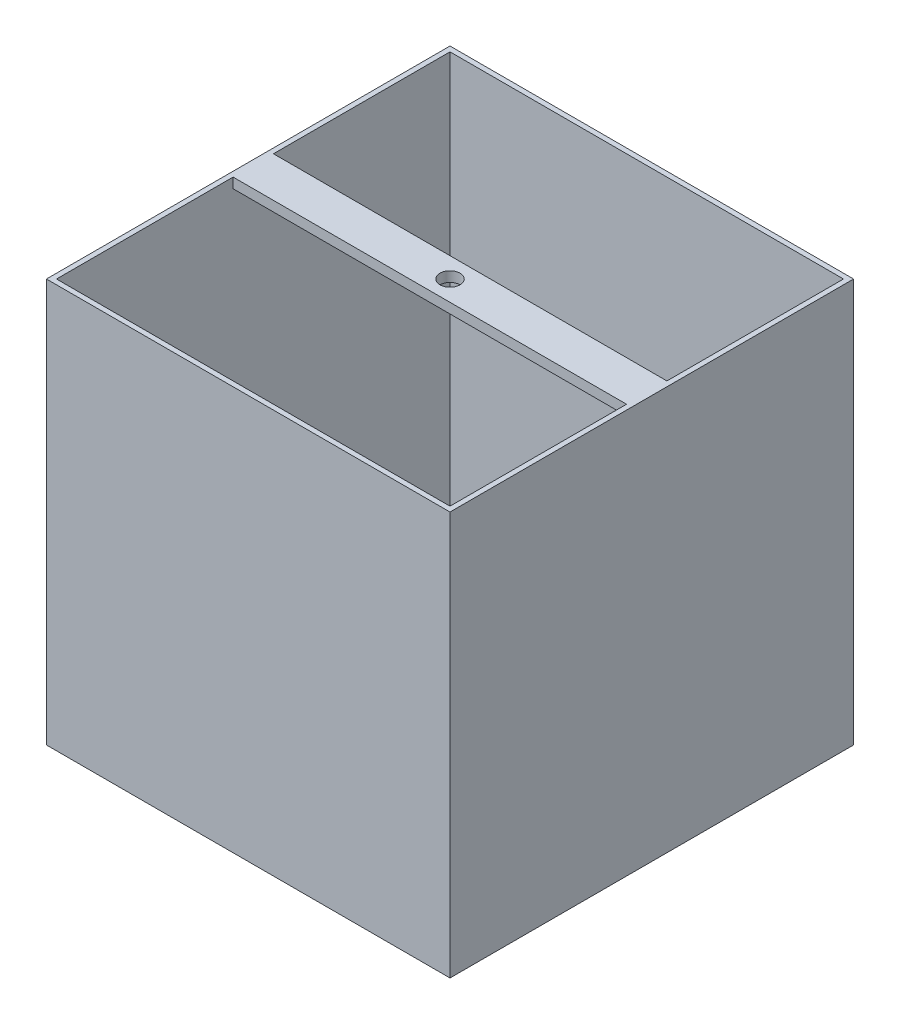
ISO-10303-21;
HEADER;
FILE_DESCRIPTION(('STEP AP214'),'2;1');
FILE_NAME('part.step','',(''),(''),'','','');
FILE_SCHEMA(('AUTOMOTIVE_DESIGN { 1 0 10303 214 1 1 1 1 }'));
ENDSEC;
DATA;
#1=APPLICATION_CONTEXT('core data for automotive mechanical design processes');
#2=APPLICATION_PROTOCOL_DEFINITION('international standard','automotive_design',2000,#1);
#3=PRODUCT_CONTEXT('',#1,'mechanical');
#4=PRODUCT('Part','Part','',(#3));
#5=PRODUCT_RELATED_PRODUCT_CATEGORY('part','',(#4));
#6=PRODUCT_DEFINITION_FORMATION('','',#4);
#7=PRODUCT_DEFINITION_CONTEXT('part definition',#1,'design');
#8=PRODUCT_DEFINITION('design','',#6,#7);
#9=PRODUCT_DEFINITION_SHAPE('','',#8);
#10=(LENGTH_UNIT() NAMED_UNIT(*) SI_UNIT(.MILLI.,.METRE.));
#11=(NAMED_UNIT(*) PLANE_ANGLE_UNIT() SI_UNIT($,.RADIAN.));
#12=(NAMED_UNIT(*) SI_UNIT($,.STERADIAN.) SOLID_ANGLE_UNIT());
#13=UNCERTAINTY_MEASURE_WITH_UNIT(LENGTH_MEASURE(1.E-05),#10,'distance_accuracy_value','');
#14=(GEOMETRIC_REPRESENTATION_CONTEXT(3) GLOBAL_UNCERTAINTY_ASSIGNED_CONTEXT((#13)) GLOBAL_UNIT_ASSIGNED_CONTEXT((#10,
#11,#12)) REPRESENTATION_CONTEXT('',''));
#15=CARTESIAN_POINT('',(0.,0.,0.));
#16=DIRECTION('',(0.,0.,1.));
#17=DIRECTION('',(1.,0.,0.));
#18=AXIS2_PLACEMENT_3D('',#15,#16,#17);
#19=CARTESIAN_POINT('',(127.,254.,-127.));
#20=DIRECTION('',(-1.,0.,0.));
#21=DIRECTION('',(0.,0.,1.));
#22=AXIS2_PLACEMENT_3D('',#19,#20,#21);
#23=PLANE('',#22);
#24=DIRECTION('',(0.,0.,-1.));
#25=VECTOR('',#24,1.);
#26=CARTESIAN_POINT('',(127.,0.,-127.));
#27=LINE('',#26,#25);
#28=CARTESIAN_POINT('',(127.,0.,127.));
#29=VERTEX_POINT('',#28);
#30=CARTESIAN_POINT('',(127.,0.,-127.));
#31=VERTEX_POINT('',#30);
#32=EDGE_CURVE('E188',#29,#31,#27,.T.);
#33=ORIENTED_EDGE('',*,*,#32,.T.);
#34=DIRECTION('',(0.,-1.,0.));
#35=VECTOR('',#34,1.);
#36=CARTESIAN_POINT('',(127.,254.,-127.));
#37=LINE('',#36,#35);
#38=CARTESIAN_POINT('',(127.,254.,-127.));
#39=VERTEX_POINT('',#38);
#40=EDGE_CURVE('E11',#39,#31,#37,.T.);
#41=ORIENTED_EDGE('',*,*,#40,.F.);
#42=DIRECTION('',(0.,0.,-1.));
#43=VECTOR('',#42,1.);
#44=CARTESIAN_POINT('',(127.,254.,-127.));
#45=LINE('',#44,#43);
#46=CARTESIAN_POINT('',(127.,254.,127.));
#47=VERTEX_POINT('',#46);
#48=EDGE_CURVE('E195',#47,#39,#45,.T.);
#49=ORIENTED_EDGE('',*,*,#48,.F.);
#50=DIRECTION('',(0.,-1.,0.));
#51=VECTOR('',#50,1.);
#52=CARTESIAN_POINT('',(127.,254.,127.));
#53=LINE('',#52,#51);
#54=EDGE_CURVE('E205',#47,#29,#53,.T.);
#55=ORIENTED_EDGE('',*,*,#54,.T.);
#56=EDGE_LOOP('',(#33,#41,#49,#55));
#57=FACE_BOUND('',#56,.T.);
#58=ADVANCED_FACE('F36',(#57),#23,.F.);
#59=CARTESIAN_POINT('',(-127.,254.,-127.));
#60=DIRECTION('',(0.,0.,1.));
#61=DIRECTION('',(1.,0.,0.));
#62=AXIS2_PLACEMENT_3D('',#59,#60,#61);
#63=PLANE('',#62);
#64=DIRECTION('',(-1.,0.,0.));
#65=VECTOR('',#64,1.);
#66=CARTESIAN_POINT('',(-127.,0.,-127.));
#67=LINE('',#66,#65);
#68=CARTESIAN_POINT('',(-127.,0.,-127.));
#69=VERTEX_POINT('',#68);
#70=EDGE_CURVE('E208',#31,#69,#67,.T.);
#71=ORIENTED_EDGE('',*,*,#70,.T.);
#72=DIRECTION('',(0.,-1.,0.));
#73=VECTOR('',#72,1.);
#74=CARTESIAN_POINT('',(-127.,254.,-127.));
#75=LINE('',#74,#73);
#76=CARTESIAN_POINT('',(-127.,254.,-127.));
#77=VERTEX_POINT('',#76);
#78=EDGE_CURVE('E43',#77,#69,#75,.T.);
#79=ORIENTED_EDGE('',*,*,#78,.F.);
#80=DIRECTION('',(-1.,0.,0.));
#81=VECTOR('',#80,1.);
#82=CARTESIAN_POINT('',(-127.,254.,-127.));
#83=LINE('',#82,#81);
#84=EDGE_CURVE('E198',#39,#77,#83,.T.);
#85=ORIENTED_EDGE('',*,*,#84,.F.);
#86=ORIENTED_EDGE('',*,*,#40,.T.);
#87=EDGE_LOOP('',(#71,#79,#85,#86));
#88=FACE_BOUND('',#87,.T.);
#89=ADVANCED_FACE('F238',(#88),#63,.F.);
#90=CARTESIAN_POINT('',(-127.,254.,-127.));
#91=DIRECTION('',(1.,0.,0.));
#92=DIRECTION('',(0.,0.,-1.));
#93=AXIS2_PLACEMENT_3D('',#90,#91,#92);
#94=PLANE('',#93);
#95=DIRECTION('',(0.,0.,1.));
#96=VECTOR('',#95,1.);
#97=CARTESIAN_POINT('',(-127.,0.,-127.));
#98=LINE('',#97,#96);
#99=CARTESIAN_POINT('',(-127.,0.,127.));
#100=VERTEX_POINT('',#99);
#101=EDGE_CURVE('E210',#69,#100,#98,.T.);
#102=ORIENTED_EDGE('',*,*,#101,.T.);
#103=DIRECTION('',(0.,-1.,0.));
#104=VECTOR('',#103,1.);
#105=CARTESIAN_POINT('',(-127.,254.,127.));
#106=LINE('',#105,#104);
#107=CARTESIAN_POINT('',(-127.,254.,127.));
#108=VERTEX_POINT('',#107);
#109=EDGE_CURVE('E215',#108,#100,#106,.T.);
#110=ORIENTED_EDGE('',*,*,#109,.F.);
#111=DIRECTION('',(0.,0.,1.));
#112=VECTOR('',#111,1.);
#113=CARTESIAN_POINT('',(-127.,254.,-127.));
#114=LINE('',#113,#112);
#115=EDGE_CURVE('E201',#77,#108,#114,.T.);
#116=ORIENTED_EDGE('',*,*,#115,.F.);
#117=ORIENTED_EDGE('',*,*,#78,.T.);
#118=EDGE_LOOP('',(#102,#110,#116,#117));
#119=FACE_BOUND('',#118,.T.);
#120=ADVANCED_FACE('F222',(#119),#94,.F.);
#121=CARTESIAN_POINT('',(-127.,254.,127.));
#122=DIRECTION('',(0.,0.,-1.));
#123=DIRECTION('',(-1.,0.,0.));
#124=AXIS2_PLACEMENT_3D('',#121,#122,#123);
#125=PLANE('',#124);
#126=DIRECTION('',(1.,0.,0.));
#127=VECTOR('',#126,1.);
#128=CARTESIAN_POINT('',(-127.,0.,127.));
#129=LINE('',#128,#127);
#130=EDGE_CURVE('E199',#100,#29,#129,.T.);
#131=ORIENTED_EDGE('',*,*,#130,.T.);
#132=ORIENTED_EDGE('',*,*,#54,.F.);
#133=DIRECTION('',(1.,0.,0.));
#134=VECTOR('',#133,1.);
#135=CARTESIAN_POINT('',(-127.,254.,127.));
#136=LINE('',#135,#134);
#137=EDGE_CURVE('E203',#108,#47,#136,.T.);
#138=ORIENTED_EDGE('',*,*,#137,.F.);
#139=ORIENTED_EDGE('',*,*,#109,.T.);
#140=EDGE_LOOP('',(#131,#132,#138,#139));
#141=FACE_BOUND('',#140,.T.);
#142=ADVANCED_FACE('F231',(#141),#125,.F.);
#143=CARTESIAN_POINT('',(0.,254.,0.));
#144=DIRECTION('',(0.,1.,0.));
#145=DIRECTION('',(0.,0.,1.));
#146=AXIS2_PLACEMENT_3D('',#143,#144,#145);
#147=PLANE('',#146);
#148=DIRECTION('',(0.,0.,-1.));
#149=VECTOR('',#148,1.);
#150=CARTESIAN_POINT('',(123.825,254.,-123.825));
#151=LINE('',#150,#149);
#152=CARTESIAN_POINT('',(123.825,254.,-12.7));
#153=VERTEX_POINT('',#152);
#154=CARTESIAN_POINT('',(123.825,254.,-123.825));
#155=VERTEX_POINT('',#154);
#156=EDGE_CURVE('E123',#153,#155,#151,.T.);
#157=ORIENTED_EDGE('',*,*,#156,.F.);
#158=DIRECTION('',(-1.,0.,0.));
#159=VECTOR('',#158,1.);
#160=CARTESIAN_POINT('',(-123.825,254.,-12.7));
#161=LINE('',#160,#159);
#162=CARTESIAN_POINT('',(-123.825,254.,-12.7));
#163=VERTEX_POINT('',#162);
#164=EDGE_CURVE('E128',#153,#163,#161,.T.);
#165=ORIENTED_EDGE('',*,*,#164,.T.);
#166=DIRECTION('',(0.,0.,1.));
#167=VECTOR('',#166,1.);
#168=CARTESIAN_POINT('',(-123.825,254.,-123.825));
#169=LINE('',#168,#167);
#170=CARTESIAN_POINT('',(-123.825,254.,-123.825));
#171=VERTEX_POINT('',#170);
#172=EDGE_CURVE('E182',#171,#163,#169,.T.);
#173=ORIENTED_EDGE('',*,*,#172,.F.);
#174=DIRECTION('',(-1.,0.,0.));
#175=VECTOR('',#174,1.);
#176=CARTESIAN_POINT('',(-123.825,254.,-123.825));
#177=LINE('',#176,#175);
#178=EDGE_CURVE('E130',#155,#171,#177,.T.);
#179=ORIENTED_EDGE('',*,*,#178,.F.);
#180=EDGE_LOOP('',(#157,#165,#173,#179));
#181=FACE_BOUND('',#180,.T.);
#182=CARTESIAN_POINT('',(123.825,254.,123.825));
#183=VERTEX_POINT('',#182);
#184=CARTESIAN_POINT('',(123.825,254.,12.7));
#185=VERTEX_POINT('',#184);
#186=EDGE_CURVE('E132',#183,#185,#151,.T.);
#187=ORIENTED_EDGE('',*,*,#186,.F.);
#188=DIRECTION('',(1.,0.,0.));
#189=VECTOR('',#188,1.);
#190=CARTESIAN_POINT('',(-123.825,254.,123.825));
#191=LINE('',#190,#189);
#192=CARTESIAN_POINT('',(-123.825,254.,123.825));
#193=VERTEX_POINT('',#192);
#194=EDGE_CURVE('E170',#193,#183,#191,.T.);
#195=ORIENTED_EDGE('',*,*,#194,.F.);
#196=CARTESIAN_POINT('',(-123.825,254.,12.7));
#197=VERTEX_POINT('',#196);
#198=EDGE_CURVE('E181',#197,#193,#169,.T.);
#199=ORIENTED_EDGE('',*,*,#198,.F.);
#200=DIRECTION('',(1.,0.,0.));
#201=VECTOR('',#200,1.);
#202=CARTESIAN_POINT('',(-123.825,254.,12.7));
#203=LINE('',#202,#201);
#204=EDGE_CURVE('E145',#197,#185,#203,.T.);
#205=ORIENTED_EDGE('',*,*,#204,.T.);
#206=EDGE_LOOP('',(#187,#195,#199,#205));
#207=FACE_BOUND('',#206,.T.);
#208=ORIENTED_EDGE('',*,*,#48,.T.);
#209=ORIENTED_EDGE('',*,*,#84,.T.);
#210=ORIENTED_EDGE('',*,*,#115,.T.);
#211=ORIENTED_EDGE('',*,*,#137,.T.);
#212=EDGE_LOOP('',(#208,#209,#210,#211));
#213=FACE_BOUND('',#212,.T.);
#214=CARTESIAN_POINT('',(0.,254.,0.));
#215=DIRECTION('',(0.,1.,0.));
#216=DIRECTION('',(0.,0.,1.));
#217=AXIS2_PLACEMENT_3D('',#214,#215,#216);
#218=CIRCLE('',#217,6.34999999999999);
#219=CARTESIAN_POINT('',(0.,254.,6.34999999999999));
#220=VERTEX_POINT('',#219);
#221=EDGE_CURVE('E151',#220,#220,#218,.T.);
#222=ORIENTED_EDGE('',*,*,#221,.F.);
#223=EDGE_LOOP('',(#222));
#224=FACE_BOUND('',#223,.T.);
#225=ADVANCED_FACE('F124',(#181,#207,#213,#224),#147,.T.);
#226=CARTESIAN_POINT('',(0.,0.,0.));
#227=DIRECTION('',(0.,1.,0.));
#228=DIRECTION('',(0.,0.,1.));
#229=AXIS2_PLACEMENT_3D('',#226,#227,#228);
#230=PLANE('',#229);
#231=CARTESIAN_POINT('',(0.,0.,0.));
#232=DIRECTION('',(0.,1.,0.));
#233=DIRECTION('',(0.,0.,1.));
#234=AXIS2_PLACEMENT_3D('',#231,#232,#233);
#235=CIRCLE('',#234,6.35);
#236=CARTESIAN_POINT('',(0.,0.,6.35));
#237=VERTEX_POINT('',#236);
#238=EDGE_CURVE('E133',#237,#237,#235,.T.);
#239=ORIENTED_EDGE('',*,*,#238,.T.);
#240=EDGE_LOOP('',(#239));
#241=FACE_BOUND('',#240,.T.);
#242=ORIENTED_EDGE('',*,*,#32,.F.);
#243=ORIENTED_EDGE('',*,*,#130,.F.);
#244=ORIENTED_EDGE('',*,*,#101,.F.);
#245=ORIENTED_EDGE('',*,*,#70,.F.);
#246=EDGE_LOOP('',(#242,#243,#244,#245));
#247=FACE_BOUND('',#246,.T.);
#248=ADVANCED_FACE('F228',(#241,#247),#230,.F.);
#249=CARTESIAN_POINT('',(123.825,6.35000000000002,-123.825));
#250=DIRECTION('',(1.,0.,0.));
#251=DIRECTION('',(0.,0.,-1.));
#252=AXIS2_PLACEMENT_3D('',#249,#250,#251);
#253=PLANE('',#252);
#254=ORIENTED_EDGE('',*,*,#186,.T.);
#255=DIRECTION('',(0.,1.,0.));
#256=VECTOR('',#255,1.);
#257=CARTESIAN_POINT('',(123.825,247.65,12.7));
#258=LINE('',#257,#256);
#259=CARTESIAN_POINT('',(123.825,247.65,12.7));
#260=VERTEX_POINT('',#259);
#261=EDGE_CURVE('E50',#260,#185,#258,.T.);
#262=ORIENTED_EDGE('',*,*,#261,.F.);
#263=DIRECTION('',(0.,0.,-1.));
#264=VECTOR('',#263,1.);
#265=CARTESIAN_POINT('',(123.825,247.65,-12.7));
#266=LINE('',#265,#264);
#267=CARTESIAN_POINT('',(123.825,247.65,-12.7));
#268=VERTEX_POINT('',#267);
#269=EDGE_CURVE('E54',#260,#268,#266,.T.);
#270=ORIENTED_EDGE('',*,*,#269,.T.);
#271=DIRECTION('',(0.,1.,0.));
#272=VECTOR('',#271,1.);
#273=CARTESIAN_POINT('',(123.825,247.65,-12.7));
#274=LINE('',#273,#272);
#275=EDGE_CURVE('E135',#268,#153,#274,.T.);
#276=ORIENTED_EDGE('',*,*,#275,.T.);
#277=ORIENTED_EDGE('',*,*,#156,.T.);
#278=DIRECTION('',(0.,1.,0.));
#279=VECTOR('',#278,1.);
#280=CARTESIAN_POINT('',(123.825,6.35000000000002,-123.825));
#281=LINE('',#280,#279);
#282=CARTESIAN_POINT('',(123.825,6.35000000000002,-123.825));
#283=VERTEX_POINT('',#282);
#284=EDGE_CURVE('E178',#283,#155,#281,.T.);
#285=ORIENTED_EDGE('',*,*,#284,.F.);
#286=DIRECTION('',(0.,0.,-1.));
#287=VECTOR('',#286,1.);
#288=CARTESIAN_POINT('',(123.825,6.35000000000002,-123.825));
#289=LINE('',#288,#287);
#290=CARTESIAN_POINT('',(123.825,6.35000000000002,123.825));
#291=VERTEX_POINT('',#290);
#292=EDGE_CURVE('E166',#291,#283,#289,.T.);
#293=ORIENTED_EDGE('',*,*,#292,.F.);
#294=DIRECTION('',(0.,1.,0.));
#295=VECTOR('',#294,1.);
#296=CARTESIAN_POINT('',(123.825,6.35000000000002,123.825));
#297=LINE('',#296,#295);
#298=EDGE_CURVE('E186',#291,#183,#297,.T.);
#299=ORIENTED_EDGE('',*,*,#298,.T.);
#300=EDGE_LOOP('',(#254,#262,#270,#276,#277,#285,#293,#299));
#301=FACE_BOUND('',#300,.T.);
#302=ADVANCED_FACE('F136',(#301),#253,.F.);
#303=CARTESIAN_POINT('',(-123.825,6.35000000000002,123.825));
#304=DIRECTION('',(0.,0.,1.));
#305=DIRECTION('',(1.,0.,0.));
#306=AXIS2_PLACEMENT_3D('',#303,#304,#305);
#307=PLANE('',#306);
#308=ORIENTED_EDGE('',*,*,#194,.T.);
#309=ORIENTED_EDGE('',*,*,#298,.F.);
#310=DIRECTION('',(1.,0.,0.));
#311=VECTOR('',#310,1.);
#312=CARTESIAN_POINT('',(-123.825,6.35000000000002,123.825));
#313=LINE('',#312,#311);
#314=CARTESIAN_POINT('',(-123.825,6.35000000000002,123.825));
#315=VERTEX_POINT('',#314);
#316=EDGE_CURVE('E176',#315,#291,#313,.T.);
#317=ORIENTED_EDGE('',*,*,#316,.F.);
#318=DIRECTION('',(0.,1.,0.));
#319=VECTOR('',#318,1.);
#320=CARTESIAN_POINT('',(-123.825,6.35000000000002,123.825));
#321=LINE('',#320,#319);
#322=EDGE_CURVE('E189',#315,#193,#321,.T.);
#323=ORIENTED_EDGE('',*,*,#322,.T.);
#324=EDGE_LOOP('',(#308,#309,#317,#323));
#325=FACE_BOUND('',#324,.T.);
#326=ADVANCED_FACE('F255',(#325),#307,.F.);
#327=CARTESIAN_POINT('',(-123.825,6.35000000000002,-123.825));
#328=DIRECTION('',(-1.,0.,0.));
#329=DIRECTION('',(0.,0.,1.));
#330=AXIS2_PLACEMENT_3D('',#327,#328,#329);
#331=PLANE('',#330);
#332=DIRECTION('',(0.,0.,1.));
#333=VECTOR('',#332,1.);
#334=CARTESIAN_POINT('',(-123.825,247.65,-12.7));
#335=LINE('',#334,#333);
#336=CARTESIAN_POINT('',(-123.825,247.65,-12.7));
#337=VERTEX_POINT('',#336);
#338=CARTESIAN_POINT('',(-123.825,247.65,12.7));
#339=VERTEX_POINT('',#338);
#340=EDGE_CURVE('E298',#337,#339,#335,.T.);
#341=ORIENTED_EDGE('',*,*,#340,.T.);
#342=DIRECTION('',(0.,1.,0.));
#343=VECTOR('',#342,1.);
#344=CARTESIAN_POINT('',(-123.825,247.65,12.7));
#345=LINE('',#344,#343);
#346=EDGE_CURVE('E158',#339,#197,#345,.T.);
#347=ORIENTED_EDGE('',*,*,#346,.T.);
#348=ORIENTED_EDGE('',*,*,#198,.T.);
#349=ORIENTED_EDGE('',*,*,#322,.F.);
#350=DIRECTION('',(0.,0.,1.));
#351=VECTOR('',#350,1.);
#352=CARTESIAN_POINT('',(-123.825,6.35000000000002,-123.825));
#353=LINE('',#352,#351);
#354=CARTESIAN_POINT('',(-123.825,6.35000000000002,-123.825));
#355=VERTEX_POINT('',#354);
#356=EDGE_CURVE('E173',#355,#315,#353,.T.);
#357=ORIENTED_EDGE('',*,*,#356,.F.);
#358=DIRECTION('',(0.,1.,0.));
#359=VECTOR('',#358,1.);
#360=CARTESIAN_POINT('',(-123.825,6.35000000000002,-123.825));
#361=LINE('',#360,#359);
#362=EDGE_CURVE('E192',#355,#171,#361,.T.);
#363=ORIENTED_EDGE('',*,*,#362,.T.);
#364=ORIENTED_EDGE('',*,*,#172,.T.);
#365=DIRECTION('',(0.,1.,0.));
#366=VECTOR('',#365,1.);
#367=CARTESIAN_POINT('',(-123.825,247.65,-12.7));
#368=LINE('',#367,#366);
#369=EDGE_CURVE('E140',#337,#163,#368,.T.);
#370=ORIENTED_EDGE('',*,*,#369,.F.);
#371=EDGE_LOOP('',(#341,#347,#348,#349,#357,#363,#364,#370));
#372=FACE_BOUND('',#371,.T.);
#373=ADVANCED_FACE('F260',(#372),#331,.F.);
#374=CARTESIAN_POINT('',(-123.825,6.35000000000002,-123.825));
#375=DIRECTION('',(0.,0.,-1.));
#376=DIRECTION('',(-1.,0.,0.));
#377=AXIS2_PLACEMENT_3D('',#374,#375,#376);
#378=PLANE('',#377);
#379=ORIENTED_EDGE('',*,*,#178,.T.);
#380=ORIENTED_EDGE('',*,*,#362,.F.);
#381=DIRECTION('',(-1.,0.,0.));
#382=VECTOR('',#381,1.);
#383=CARTESIAN_POINT('',(-123.825,6.35000000000002,-123.825));
#384=LINE('',#383,#382);
#385=EDGE_CURVE('E169',#283,#355,#384,.T.);
#386=ORIENTED_EDGE('',*,*,#385,.F.);
#387=ORIENTED_EDGE('',*,*,#284,.T.);
#388=EDGE_LOOP('',(#379,#380,#386,#387));
#389=FACE_BOUND('',#388,.T.);
#390=ADVANCED_FACE('F256',(#389),#378,.F.);
#391=CARTESIAN_POINT('',(0.,6.35000000000002,0.));
#392=DIRECTION('',(0.,1.,0.));
#393=DIRECTION('',(0.,0.,1.));
#394=AXIS2_PLACEMENT_3D('',#391,#392,#393);
#395=PLANE('',#394);
#396=CARTESIAN_POINT('',(0.,6.35000000000002,0.));
#397=DIRECTION('',(0.,1.,0.));
#398=DIRECTION('',(0.,0.,1.));
#399=AXIS2_PLACEMENT_3D('',#396,#397,#398);
#400=CIRCLE('',#399,6.35);
#401=CARTESIAN_POINT('',(0.,6.35000000000002,6.35));
#402=VERTEX_POINT('',#401);
#403=EDGE_CURVE('E157',#402,#402,#400,.T.);
#404=ORIENTED_EDGE('',*,*,#403,.F.);
#405=EDGE_LOOP('',(#404));
#406=FACE_BOUND('',#405,.T.);
#407=ORIENTED_EDGE('',*,*,#292,.T.);
#408=ORIENTED_EDGE('',*,*,#385,.T.);
#409=ORIENTED_EDGE('',*,*,#356,.T.);
#410=ORIENTED_EDGE('',*,*,#316,.T.);
#411=EDGE_LOOP('',(#407,#408,#409,#410));
#412=FACE_BOUND('',#411,.T.);
#413=ADVANCED_FACE('F259',(#406,#412),#395,.T.);
#414=CARTESIAN_POINT('',(0.,-241.3,0.));
#415=DIRECTION('',(0.,1.,0.));
#416=DIRECTION('',(0.,0.,1.));
#417=AXIS2_PLACEMENT_3D('',#414,#415,#416);
#418=CYLINDRICAL_SURFACE('',#417,6.35);
#419=ORIENTED_EDGE('',*,*,#403,.T.);
#420=EDGE_LOOP('',(#419));
#421=FACE_BOUND('',#420,.T.);
#422=ORIENTED_EDGE('',*,*,#238,.F.);
#423=EDGE_LOOP('',(#422));
#424=FACE_BOUND('',#423,.T.);
#425=ADVANCED_FACE('F270',(#421,#424),#418,.F.);
#426=CARTESIAN_POINT('',(-123.825,247.65,12.7));
#427=DIRECTION('',(0.,0.,1.));
#428=DIRECTION('',(1.,0.,0.));
#429=AXIS2_PLACEMENT_3D('',#426,#427,#428);
#430=PLANE('',#429);
#431=ORIENTED_EDGE('',*,*,#204,.F.);
#432=ORIENTED_EDGE('',*,*,#346,.F.);
#433=DIRECTION('',(1.,0.,0.));
#434=VECTOR('',#433,1.);
#435=CARTESIAN_POINT('',(-123.825,247.65,12.7));
#436=LINE('',#435,#434);
#437=EDGE_CURVE('E141',#339,#260,#436,.T.);
#438=ORIENTED_EDGE('',*,*,#437,.T.);
#439=ORIENTED_EDGE('',*,*,#261,.T.);
#440=EDGE_LOOP('',(#431,#432,#438,#439));
#441=FACE_BOUND('',#440,.T.);
#442=ADVANCED_FACE('F274',(#441),#430,.T.);
#443=CARTESIAN_POINT('',(-123.825,247.65,-12.7));
#444=DIRECTION('',(0.,0.,-1.));
#445=DIRECTION('',(-1.,0.,0.));
#446=AXIS2_PLACEMENT_3D('',#443,#444,#445);
#447=PLANE('',#446);
#448=ORIENTED_EDGE('',*,*,#164,.F.);
#449=ORIENTED_EDGE('',*,*,#275,.F.);
#450=DIRECTION('',(-1.,0.,0.));
#451=VECTOR('',#450,1.);
#452=CARTESIAN_POINT('',(-123.825,247.65,-12.7));
#453=LINE('',#452,#451);
#454=EDGE_CURVE('E297',#268,#337,#453,.T.);
#455=ORIENTED_EDGE('',*,*,#454,.T.);
#456=ORIENTED_EDGE('',*,*,#369,.T.);
#457=EDGE_LOOP('',(#448,#449,#455,#456));
#458=FACE_BOUND('',#457,.T.);
#459=ADVANCED_FACE('F144',(#458),#447,.T.);
#460=CARTESIAN_POINT('',(0.,247.65,0.));
#461=DIRECTION('',(0.,1.,0.));
#462=DIRECTION('',(0.,0.,1.));
#463=AXIS2_PLACEMENT_3D('',#460,#461,#462);
#464=PLANE('',#463);
#465=CARTESIAN_POINT('',(0.,247.65,0.));
#466=DIRECTION('',(0.,1.,0.));
#467=DIRECTION('',(0.,0.,1.));
#468=AXIS2_PLACEMENT_3D('',#465,#466,#467);
#469=CIRCLE('',#468,6.34999999999999);
#470=CARTESIAN_POINT('',(0.,247.65,6.34999999999999));
#471=VERTEX_POINT('',#470);
#472=EDGE_CURVE('E146',#471,#471,#469,.T.);
#473=ORIENTED_EDGE('',*,*,#472,.T.);
#474=EDGE_LOOP('',(#473));
#475=FACE_BOUND('',#474,.T.);
#476=ORIENTED_EDGE('',*,*,#269,.F.);
#477=ORIENTED_EDGE('',*,*,#437,.F.);
#478=ORIENTED_EDGE('',*,*,#340,.F.);
#479=ORIENTED_EDGE('',*,*,#454,.F.);
#480=EDGE_LOOP('',(#476,#477,#478,#479));
#481=FACE_BOUND('',#480,.T.);
#482=ADVANCED_FACE('F278',(#475,#481),#464,.F.);
#483=CARTESIAN_POINT('',(0.,247.65,0.));
#484=DIRECTION('',(0.,1.,0.));
#485=DIRECTION('',(0.,0.,1.));
#486=AXIS2_PLACEMENT_3D('',#483,#484,#485);
#487=CYLINDRICAL_SURFACE('',#486,6.34999999999999);
#488=ORIENTED_EDGE('',*,*,#472,.F.);
#489=EDGE_LOOP('',(#488));
#490=FACE_BOUND('',#489,.T.);
#491=ORIENTED_EDGE('',*,*,#221,.T.);
#492=EDGE_LOOP('',(#491));
#493=FACE_BOUND('',#492,.T.);
#494=ADVANCED_FACE('F284',(#490,#493),#487,.F.);
#495=CLOSED_SHELL('',(#58,#89,#120,#142,#225,#248,#302,#326,#373,#390,#413,#425,#442,#459,#482,#494));
#496=MANIFOLD_SOLID_BREP('B2',#495);
#497=ADVANCED_BREP_SHAPE_REPRESENTATION('',(#18,#496),#14);
#498=SHAPE_DEFINITION_REPRESENTATION(#9,#497);
ENDSEC;
END-ISO-10303-21;
